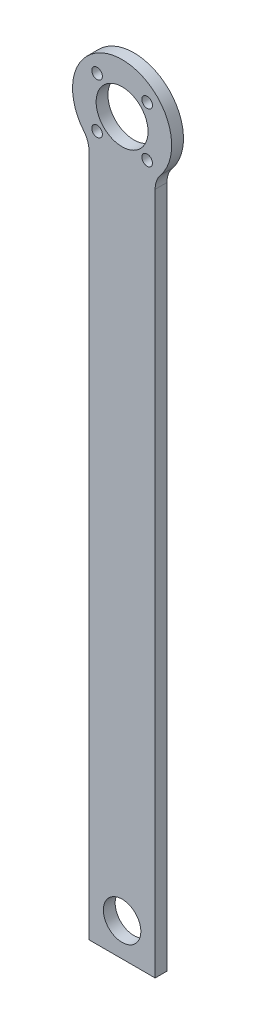
ISO-10303-21;
HEADER;
FILE_DESCRIPTION(('STEP AP214'),'2;1');
FILE_NAME('part.step','',(''),(''),'','','');
FILE_SCHEMA(('AUTOMOTIVE_DESIGN { 1 0 10303 214 1 1 1 1 }'));
ENDSEC;
DATA;
#1=APPLICATION_CONTEXT('core data for automotive mechanical design processes');
#2=APPLICATION_PROTOCOL_DEFINITION('international standard','automotive_design',2000,#1);
#3=PRODUCT_CONTEXT('',#1,'mechanical');
#4=PRODUCT('Part','Part','',(#3));
#5=PRODUCT_RELATED_PRODUCT_CATEGORY('part','',(#4));
#6=PRODUCT_DEFINITION_FORMATION('','',#4);
#7=PRODUCT_DEFINITION_CONTEXT('part definition',#1,'design');
#8=PRODUCT_DEFINITION('design','',#6,#7);
#9=PRODUCT_DEFINITION_SHAPE('','',#8);
#10=(LENGTH_UNIT() NAMED_UNIT(*) SI_UNIT(.MILLI.,.METRE.));
#11=(NAMED_UNIT(*) PLANE_ANGLE_UNIT() SI_UNIT($,.RADIAN.));
#12=(NAMED_UNIT(*) SI_UNIT($,.STERADIAN.) SOLID_ANGLE_UNIT());
#13=UNCERTAINTY_MEASURE_WITH_UNIT(LENGTH_MEASURE(1.E-05),#10,'distance_accuracy_value','');
#14=(GEOMETRIC_REPRESENTATION_CONTEXT(3) GLOBAL_UNCERTAINTY_ASSIGNED_CONTEXT((#13)) GLOBAL_UNIT_ASSIGNED_CONTEXT((#10,
#11,#12)) REPRESENTATION_CONTEXT('',''));
#15=CARTESIAN_POINT('',(0.,0.,0.));
#16=DIRECTION('',(0.,0.,1.));
#17=DIRECTION('',(1.,0.,0.));
#18=AXIS2_PLACEMENT_3D('',#15,#16,#17);
#19=CARTESIAN_POINT('',(42.,0.,4.99999999999998));
#20=DIRECTION('',(0.,0.,-1.));
#21=DIRECTION('',(-1.,0.,0.));
#22=AXIS2_PLACEMENT_3D('',#19,#20,#21);
#23=PLANE('',#22);
#24=CARTESIAN_POINT('',(21.,14.,4.99999999999999));
#25=DIRECTION('',(0.,0.,-1.));
#26=DIRECTION('',(-1.,0.,0.));
#27=AXIS2_PLACEMENT_3D('',#24,#25,#26);
#28=CIRCLE('',#27,7.9375);
#29=CARTESIAN_POINT('',(21.,21.9375,4.99999999999999));
#30=VERTEX_POINT('',#29);
#31=EDGE_CURVE('E309',#30,#30,#28,.F.);
#32=ORIENTED_EDGE('',*,*,#31,.F.);
#33=EDGE_LOOP('',(#32));
#34=FACE_BOUND('',#33,.T.);
#35=CARTESIAN_POINT('',(31.6066017177982,319.606601717798,4.99999999999998));
#36=DIRECTION('',(0.,0.,1.));
#37=DIRECTION('',(1.,0.,0.));
#38=AXIS2_PLACEMENT_3D('',#35,#36,#37);
#39=CIRCLE('',#38,2.25);
#40=CARTESIAN_POINT('',(33.8566017177982,319.606601717798,4.99999999999998));
#41=VERTEX_POINT('',#40);
#42=EDGE_CURVE('E324',#41,#41,#39,.T.);
#43=ORIENTED_EDGE('',*,*,#42,.F.);
#44=EDGE_LOOP('',(#43));
#45=FACE_BOUND('',#44,.T.);
#46=CARTESIAN_POINT('',(10.3933982822018,298.393398282202,4.99999999999998));
#47=DIRECTION('',(0.,0.,1.));
#48=DIRECTION('',(1.,0.,0.));
#49=AXIS2_PLACEMENT_3D('',#46,#47,#48);
#50=CIRCLE('',#49,2.25);
#51=CARTESIAN_POINT('',(12.6433982822018,298.393398282202,4.99999999999998));
#52=VERTEX_POINT('',#51);
#53=EDGE_CURVE('E186',#52,#52,#50,.T.);
#54=ORIENTED_EDGE('',*,*,#53,.F.);
#55=EDGE_LOOP('',(#54));
#56=FACE_BOUND('',#55,.T.);
#57=CARTESIAN_POINT('',(21.,309.,4.99999999999998));
#58=DIRECTION('',(0.,0.,1.));
#59=DIRECTION('',(1.,0.,0.));
#60=AXIS2_PLACEMENT_3D('',#57,#58,#59);
#61=CIRCLE('',#60,11.);
#62=CARTESIAN_POINT('',(32.,309.,4.99999999999998));
#63=VERTEX_POINT('',#62);
#64=EDGE_CURVE('E183',#63,#63,#61,.T.);
#65=ORIENTED_EDGE('',*,*,#64,.F.);
#66=EDGE_LOOP('',(#65));
#67=FACE_BOUND('',#66,.T.);
#68=DIRECTION('',(0.,-1.,0.));
#69=VECTOR('',#68,1.);
#70=CARTESIAN_POINT('',(35.,293.347524157502,5.00000000000006));
#71=LINE('',#70,#69);
#72=CARTESIAN_POINT('',(35.,289.378583129652,5.00000000000006));
#73=VERTEX_POINT('',#72);
#74=CARTESIAN_POINT('',(35.,0.,5.));
#75=VERTEX_POINT('',#74);
#76=EDGE_CURVE('E127',#73,#75,#71,.T.);
#77=ORIENTED_EDGE('',*,*,#76,.F.);
#78=CARTESIAN_POINT('',(45.,289.378583129652,4.99999999999998));
#79=DIRECTION('',(0.,0.,-1.));
#80=DIRECTION('',(-1.,0.,0.));
#81=AXIS2_PLACEMENT_3D('',#78,#79,#80);
#82=CIRCLE('',#81,10.);
#83=CARTESIAN_POINT('',(37.258064516129,295.708072442667,4.99999999999998));
#84=VERTEX_POINT('',#83);
#85=EDGE_CURVE('E14',#73,#84,#82,.T.);
#86=ORIENTED_EDGE('',*,*,#85,.T.);
#87=CARTESIAN_POINT('',(21.,309.,4.99999999999998));
#88=DIRECTION('',(0.,0.,1.));
#89=DIRECTION('',(1.,0.,0.));
#90=AXIS2_PLACEMENT_3D('',#87,#88,#89);
#91=CIRCLE('',#90,21.);
#92=CARTESIAN_POINT('',(4.74193548387091,295.708072442667,4.99999999999998));
#93=VERTEX_POINT('',#92);
#94=EDGE_CURVE('E167',#84,#93,#91,.T.);
#95=ORIENTED_EDGE('',*,*,#94,.T.);
#96=CARTESIAN_POINT('',(-3.00000000000007,289.378583129652,4.99999999999998));
#97=DIRECTION('',(0.,0.,-1.));
#98=DIRECTION('',(-1.,0.,0.));
#99=AXIS2_PLACEMENT_3D('',#96,#97,#98);
#100=CIRCLE('',#99,10.);
#101=CARTESIAN_POINT('',(6.99999999999993,289.378583129652,5.00000000000006));
#102=VERTEX_POINT('',#101);
#103=EDGE_CURVE('E159',#93,#102,#100,.T.);
#104=ORIENTED_EDGE('',*,*,#103,.T.);
#105=DIRECTION('',(0.,1.,0.));
#106=VECTOR('',#105,1.);
#107=CARTESIAN_POINT('',(6.99999999999997,0.,5.00000000000006));
#108=LINE('',#107,#106);
#109=CARTESIAN_POINT('',(6.99999999999997,0.,5.00000000000006));
#110=VERTEX_POINT('',#109);
#111=EDGE_CURVE('E137',#110,#102,#108,.T.);
#112=ORIENTED_EDGE('',*,*,#111,.F.);
#113=DIRECTION('',(-1.,0.,0.));
#114=VECTOR('',#113,1.);
#115=CARTESIAN_POINT('',(42.,0.,4.99999999999998));
#116=LINE('',#115,#114);
#117=EDGE_CURVE('E143',#75,#110,#116,.T.);
#118=ORIENTED_EDGE('',*,*,#117,.F.);
#119=EDGE_LOOP('',(#77,#86,#95,#104,#112,#118));
#120=FACE_BOUND('',#119,.T.);
#121=CARTESIAN_POINT('',(31.6066017177982,298.393398282202,4.99999999999998));
#122=DIRECTION('',(0.,0.,1.));
#123=DIRECTION('',(1.,0.,0.));
#124=AXIS2_PLACEMENT_3D('',#121,#122,#123);
#125=CIRCLE('',#124,2.25);
#126=CARTESIAN_POINT('',(33.8566017177982,298.393398282202,4.99999999999998));
#127=VERTEX_POINT('',#126);
#128=EDGE_CURVE('E330',#127,#127,#125,.T.);
#129=ORIENTED_EDGE('',*,*,#128,.F.);
#130=EDGE_LOOP('',(#129));
#131=FACE_BOUND('',#130,.T.);
#132=CARTESIAN_POINT('',(10.3933982822018,319.606601717798,4.99999999999998));
#133=DIRECTION('',(0.,0.,1.));
#134=DIRECTION('',(1.,0.,0.));
#135=AXIS2_PLACEMENT_3D('',#132,#133,#134);
#136=CIRCLE('',#135,2.25);
#137=CARTESIAN_POINT('',(12.6433982822018,319.606601717798,4.99999999999998));
#138=VERTEX_POINT('',#137);
#139=EDGE_CURVE('E315',#138,#138,#136,.T.);
#140=ORIENTED_EDGE('',*,*,#139,.F.);
#141=EDGE_LOOP('',(#140));
#142=FACE_BOUND('',#141,.T.);
#143=ADVANCED_FACE('F74',(#34,#45,#56,#67,#120,#131,#142),#23,.F.);
#144=CARTESIAN_POINT('',(42.,330.,0.));
#145=DIRECTION('',(0.,0.,1.));
#146=DIRECTION('',(0.,-1.,0.));
#147=AXIS2_PLACEMENT_3D('',#144,#145,#146);
#148=PLANE('',#147);
#149=CARTESIAN_POINT('',(21.,14.,0.));
#150=DIRECTION('',(0.,0.,-1.));
#151=DIRECTION('',(0.,1.,0.));
#152=AXIS2_PLACEMENT_3D('',#149,#150,#151);
#153=CIRCLE('',#152,7.9375);
#154=CARTESIAN_POINT('',(21.,21.9375,0.));
#155=VERTEX_POINT('',#154);
#156=EDGE_CURVE('E311',#155,#155,#153,.T.);
#157=ORIENTED_EDGE('',*,*,#156,.F.);
#158=EDGE_LOOP('',(#157));
#159=FACE_BOUND('',#158,.T.);
#160=CARTESIAN_POINT('',(10.3933982822018,319.606601717798,0.));
#161=DIRECTION('',(0.,0.,1.));
#162=DIRECTION('',(0.,-1.,0.));
#163=AXIS2_PLACEMENT_3D('',#160,#161,#162);
#164=CIRCLE('',#163,2.25);
#165=CARTESIAN_POINT('',(10.3933982822018,317.356601717798,0.));
#166=VERTEX_POINT('',#165);
#167=EDGE_CURVE('E321',#166,#166,#164,.T.);
#168=ORIENTED_EDGE('',*,*,#167,.T.);
#169=EDGE_LOOP('',(#168));
#170=FACE_BOUND('',#169,.T.);
#171=CARTESIAN_POINT('',(31.6066017177982,319.606601717798,0.));
#172=DIRECTION('',(0.,0.,1.));
#173=DIRECTION('',(0.,-1.,0.));
#174=AXIS2_PLACEMENT_3D('',#171,#172,#173);
#175=CIRCLE('',#174,2.25);
#176=CARTESIAN_POINT('',(31.6066017177982,317.356601717798,0.));
#177=VERTEX_POINT('',#176);
#178=EDGE_CURVE('E327',#177,#177,#175,.T.);
#179=ORIENTED_EDGE('',*,*,#178,.T.);
#180=EDGE_LOOP('',(#179));
#181=FACE_BOUND('',#180,.T.);
#182=CARTESIAN_POINT('',(31.6066017177982,298.393398282202,0.));
#183=DIRECTION('',(0.,0.,1.));
#184=DIRECTION('',(0.,-1.,0.));
#185=AXIS2_PLACEMENT_3D('',#182,#183,#184);
#186=CIRCLE('',#185,2.25);
#187=CARTESIAN_POINT('',(31.6066017177982,296.143398282202,0.));
#188=VERTEX_POINT('',#187);
#189=EDGE_CURVE('E333',#188,#188,#186,.T.);
#190=ORIENTED_EDGE('',*,*,#189,.T.);
#191=EDGE_LOOP('',(#190));
#192=FACE_BOUND('',#191,.T.);
#193=CARTESIAN_POINT('',(10.3933982822018,298.393398282202,0.));
#194=DIRECTION('',(0.,0.,1.));
#195=DIRECTION('',(0.,-1.,0.));
#196=AXIS2_PLACEMENT_3D('',#193,#194,#195);
#197=CIRCLE('',#196,2.25);
#198=CARTESIAN_POINT('',(10.3933982822018,296.143398282202,0.));
#199=VERTEX_POINT('',#198);
#200=EDGE_CURVE('E181',#199,#199,#197,.T.);
#201=ORIENTED_EDGE('',*,*,#200,.T.);
#202=EDGE_LOOP('',(#201));
#203=FACE_BOUND('',#202,.T.);
#204=CARTESIAN_POINT('',(21.,309.,0.));
#205=DIRECTION('',(0.,0.,1.));
#206=DIRECTION('',(0.,-1.,0.));
#207=AXIS2_PLACEMENT_3D('',#204,#205,#206);
#208=CIRCLE('',#207,11.);
#209=CARTESIAN_POINT('',(21.,298.,0.));
#210=VERTEX_POINT('',#209);
#211=EDGE_CURVE('E148',#210,#210,#208,.F.);
#212=ORIENTED_EDGE('',*,*,#211,.F.);
#213=EDGE_LOOP('',(#212));
#214=FACE_BOUND('',#213,.T.);
#215=DIRECTION('',(0.,-1.,0.));
#216=VECTOR('',#215,1.);
#217=CARTESIAN_POINT('',(6.99999999999997,0.,0.));
#218=LINE('',#217,#216);
#219=CARTESIAN_POINT('',(6.99999999999993,289.378583129652,0.));
#220=VERTEX_POINT('',#219);
#221=CARTESIAN_POINT('',(6.99999999999997,0.,0.));
#222=VERTEX_POINT('',#221);
#223=EDGE_CURVE('E177',#220,#222,#218,.T.);
#224=ORIENTED_EDGE('',*,*,#223,.F.);
#225=CARTESIAN_POINT('',(-3.00000000000007,289.378583129652,0.));
#226=DIRECTION('',(0.,0.,1.));
#227=DIRECTION('',(0.,-1.,0.));
#228=AXIS2_PLACEMENT_3D('',#225,#226,#227);
#229=CIRCLE('',#228,10.);
#230=CARTESIAN_POINT('',(4.74193548387091,295.708072442667,0.));
#231=VERTEX_POINT('',#230);
#232=EDGE_CURVE('E157',#220,#231,#229,.T.);
#233=ORIENTED_EDGE('',*,*,#232,.T.);
#234=CARTESIAN_POINT('',(21.,309.,0.));
#235=DIRECTION('',(0.,0.,1.));
#236=DIRECTION('',(0.,-1.,0.));
#237=AXIS2_PLACEMENT_3D('',#234,#235,#236);
#238=CIRCLE('',#237,21.);
#239=CARTESIAN_POINT('',(37.258064516129,295.708072442667,0.));
#240=VERTEX_POINT('',#239);
#241=EDGE_CURVE('E176',#231,#240,#238,.F.);
#242=ORIENTED_EDGE('',*,*,#241,.T.);
#243=CARTESIAN_POINT('',(45.,289.378583129652,0.));
#244=DIRECTION('',(0.,0.,1.));
#245=DIRECTION('',(0.,-1.,0.));
#246=AXIS2_PLACEMENT_3D('',#243,#244,#245);
#247=CIRCLE('',#246,10.);
#248=CARTESIAN_POINT('',(35.,289.378583129652,0.));
#249=VERTEX_POINT('',#248);
#250=EDGE_CURVE('E82',#240,#249,#247,.T.);
#251=ORIENTED_EDGE('',*,*,#250,.T.);
#252=DIRECTION('',(0.,1.,0.));
#253=VECTOR('',#252,1.);
#254=CARTESIAN_POINT('',(35.,293.347524157502,0.));
#255=LINE('',#254,#253);
#256=CARTESIAN_POINT('',(35.,0.,0.));
#257=VERTEX_POINT('',#256);
#258=EDGE_CURVE('E126',#257,#249,#255,.T.);
#259=ORIENTED_EDGE('',*,*,#258,.F.);
#260=DIRECTION('',(-1.,0.,0.));
#261=VECTOR('',#260,1.);
#262=CARTESIAN_POINT('',(42.,0.,0.));
#263=LINE('',#262,#261);
#264=EDGE_CURVE('E136',#257,#222,#263,.T.);
#265=ORIENTED_EDGE('',*,*,#264,.T.);
#266=EDGE_LOOP('',(#224,#233,#242,#251,#259,#265));
#267=FACE_BOUND('',#266,.T.);
#268=ADVANCED_FACE('F135',(#159,#170,#181,#192,#203,#214,#267),#148,.F.);
#269=CARTESIAN_POINT('',(42.,0.,0.));
#270=DIRECTION('',(0.,1.,0.));
#271=DIRECTION('',(0.,0.,1.));
#272=AXIS2_PLACEMENT_3D('',#269,#270,#271);
#273=PLANE('',#272);
#274=ORIENTED_EDGE('',*,*,#264,.F.);
#275=DIRECTION('',(0.,0.,-1.));
#276=VECTOR('',#275,1.);
#277=CARTESIAN_POINT('',(35.,0.,314.079277856022));
#278=LINE('',#277,#276);
#279=EDGE_CURVE('E124',#75,#257,#278,.T.);
#280=ORIENTED_EDGE('',*,*,#279,.F.);
#281=ORIENTED_EDGE('',*,*,#117,.T.);
#282=DIRECTION('',(0.,0.,-1.));
#283=VECTOR('',#282,1.);
#284=CARTESIAN_POINT('',(6.99999999999997,0.,314.079277856022));
#285=LINE('',#284,#283);
#286=EDGE_CURVE('E141',#110,#222,#285,.T.);
#287=ORIENTED_EDGE('',*,*,#286,.T.);
#288=EDGE_LOOP('',(#274,#280,#281,#287));
#289=FACE_BOUND('',#288,.T.);
#290=ADVANCED_FACE('F140',(#289),#273,.F.);
#291=CARTESIAN_POINT('',(21.,309.,-31.1126983722081));
#292=DIRECTION('',(0.,0.,1.));
#293=DIRECTION('',(1.,0.,0.));
#294=AXIS2_PLACEMENT_3D('',#291,#292,#293);
#295=CYLINDRICAL_SURFACE('',#294,21.);
#296=ORIENTED_EDGE('',*,*,#241,.F.);
#297=DIRECTION('',(0.,0.,1.));
#298=VECTOR('',#297,1.);
#299=CARTESIAN_POINT('',(4.74193548387091,295.708072442667,-31.1126983722081));
#300=LINE('',#299,#298);
#301=EDGE_CURVE('E154',#231,#93,#300,.T.);
#302=ORIENTED_EDGE('',*,*,#301,.T.);
#303=ORIENTED_EDGE('',*,*,#94,.F.);
#304=DIRECTION('',(0.,0.,1.));
#305=VECTOR('',#304,1.);
#306=CARTESIAN_POINT('',(37.258064516129,295.708072442667,-31.1126983722081));
#307=LINE('',#306,#305);
#308=EDGE_CURVE('E146',#84,#240,#307,.F.);
#309=ORIENTED_EDGE('',*,*,#308,.T.);
#310=EDGE_LOOP('',(#296,#302,#303,#309));
#311=FACE_BOUND('',#310,.T.);
#312=ADVANCED_FACE('F179',(#311),#295,.T.);
#313=CARTESIAN_POINT('',(21.,309.,-31.1126983722081));
#314=DIRECTION('',(0.,0.,1.));
#315=DIRECTION('',(1.,0.,0.));
#316=AXIS2_PLACEMENT_3D('',#313,#314,#315);
#317=CYLINDRICAL_SURFACE('',#316,11.);
#318=ORIENTED_EDGE('',*,*,#211,.T.);
#319=EDGE_LOOP('',(#318));
#320=FACE_BOUND('',#319,.T.);
#321=ORIENTED_EDGE('',*,*,#64,.T.);
#322=EDGE_LOOP('',(#321));
#323=FACE_BOUND('',#322,.T.);
#324=ADVANCED_FACE('F193',(#320,#323),#317,.F.);
#325=CARTESIAN_POINT('',(10.3933982822018,298.393398282202,4.99999999999998));
#326=DIRECTION('',(0.,0.,1.));
#327=DIRECTION('',(1.,0.,0.));
#328=AXIS2_PLACEMENT_3D('',#325,#326,#327);
#329=CYLINDRICAL_SURFACE('',#328,2.25);
#330=ORIENTED_EDGE('',*,*,#200,.F.);
#331=EDGE_LOOP('',(#330));
#332=FACE_BOUND('',#331,.T.);
#333=ORIENTED_EDGE('',*,*,#53,.T.);
#334=EDGE_LOOP('',(#333));
#335=FACE_BOUND('',#334,.T.);
#336=ADVANCED_FACE('F234',(#332,#335),#329,.F.);
#337=CARTESIAN_POINT('',(31.6066017177982,298.393398282202,4.99999999999998));
#338=DIRECTION('',(0.,0.,1.));
#339=DIRECTION('',(1.,0.,0.));
#340=AXIS2_PLACEMENT_3D('',#337,#338,#339);
#341=CYLINDRICAL_SURFACE('',#340,2.25);
#342=ORIENTED_EDGE('',*,*,#189,.F.);
#343=EDGE_LOOP('',(#342));
#344=FACE_BOUND('',#343,.T.);
#345=ORIENTED_EDGE('',*,*,#128,.T.);
#346=EDGE_LOOP('',(#345));
#347=FACE_BOUND('',#346,.T.);
#348=ADVANCED_FACE('F230',(#344,#347),#341,.F.);
#349=CARTESIAN_POINT('',(31.6066017177982,319.606601717798,4.99999999999998));
#350=DIRECTION('',(0.,0.,1.));
#351=DIRECTION('',(1.,0.,0.));
#352=AXIS2_PLACEMENT_3D('',#349,#350,#351);
#353=CYLINDRICAL_SURFACE('',#352,2.25);
#354=ORIENTED_EDGE('',*,*,#178,.F.);
#355=EDGE_LOOP('',(#354));
#356=FACE_BOUND('',#355,.T.);
#357=ORIENTED_EDGE('',*,*,#42,.T.);
#358=EDGE_LOOP('',(#357));
#359=FACE_BOUND('',#358,.T.);
#360=ADVANCED_FACE('F226',(#356,#359),#353,.F.);
#361=CARTESIAN_POINT('',(10.3933982822018,319.606601717798,4.99999999999998));
#362=DIRECTION('',(0.,0.,1.));
#363=DIRECTION('',(1.,0.,0.));
#364=AXIS2_PLACEMENT_3D('',#361,#362,#363);
#365=CYLINDRICAL_SURFACE('',#364,2.25);
#366=ORIENTED_EDGE('',*,*,#167,.F.);
#367=EDGE_LOOP('',(#366));
#368=FACE_BOUND('',#367,.T.);
#369=ORIENTED_EDGE('',*,*,#139,.T.);
#370=EDGE_LOOP('',(#369));
#371=FACE_BOUND('',#370,.T.);
#372=ADVANCED_FACE('F220',(#368,#371),#365,.F.);
#373=CARTESIAN_POINT('',(6.99999999999997,0.,314.079277856022));
#374=DIRECTION('',(1.,0.,0.));
#375=DIRECTION('',(0.,1.,0.));
#376=AXIS2_PLACEMENT_3D('',#373,#374,#375);
#377=PLANE('',#376);
#378=ORIENTED_EDGE('',*,*,#111,.T.);
#379=DIRECTION('',(0.,0.,1.));
#380=VECTOR('',#379,1.);
#381=CARTESIAN_POINT('',(6.99999999999993,289.378583129652,314.079277856022));
#382=LINE('',#381,#380);
#383=EDGE_CURVE('E142',#102,#220,#382,.F.);
#384=ORIENTED_EDGE('',*,*,#383,.T.);
#385=ORIENTED_EDGE('',*,*,#223,.T.);
#386=ORIENTED_EDGE('',*,*,#286,.F.);
#387=EDGE_LOOP('',(#378,#384,#385,#386));
#388=FACE_BOUND('',#387,.T.);
#389=ADVANCED_FACE('F172',(#388),#377,.F.);
#390=CARTESIAN_POINT('',(35.,293.347524157502,314.079277856022));
#391=DIRECTION('',(-1.,0.,0.));
#392=DIRECTION('',(0.,-1.,0.));
#393=AXIS2_PLACEMENT_3D('',#390,#391,#392);
#394=PLANE('',#393);
#395=ORIENTED_EDGE('',*,*,#258,.T.);
#396=DIRECTION('',(0.,0.,1.));
#397=VECTOR('',#396,1.);
#398=CARTESIAN_POINT('',(35.,289.378583129652,314.079277856022));
#399=LINE('',#398,#397);
#400=EDGE_CURVE('E95',#249,#73,#399,.T.);
#401=ORIENTED_EDGE('',*,*,#400,.T.);
#402=ORIENTED_EDGE('',*,*,#76,.T.);
#403=ORIENTED_EDGE('',*,*,#279,.T.);
#404=EDGE_LOOP('',(#395,#401,#402,#403));
#405=FACE_BOUND('',#404,.T.);
#406=ADVANCED_FACE('F125',(#405),#394,.F.);
#407=CARTESIAN_POINT('',(-3.00000000000007,289.378583129652,-31.1126983722081));
#408=DIRECTION('',(0.,0.,1.));
#409=DIRECTION('',(1.,0.,0.));
#410=AXIS2_PLACEMENT_3D('',#407,#408,#409);
#411=CYLINDRICAL_SURFACE('',#410,10.);
#412=ORIENTED_EDGE('',*,*,#103,.F.);
#413=ORIENTED_EDGE('',*,*,#301,.F.);
#414=ORIENTED_EDGE('',*,*,#232,.F.);
#415=ORIENTED_EDGE('',*,*,#383,.F.);
#416=EDGE_LOOP('',(#412,#413,#414,#415));
#417=FACE_BOUND('',#416,.T.);
#418=ADVANCED_FACE('F174',(#417),#411,.F.);
#419=CARTESIAN_POINT('',(45.,289.378583129652,-31.1126983722081));
#420=DIRECTION('',(0.,0.,1.));
#421=DIRECTION('',(1.,0.,0.));
#422=AXIS2_PLACEMENT_3D('',#419,#420,#421);
#423=CYLINDRICAL_SURFACE('',#422,10.);
#424=ORIENTED_EDGE('',*,*,#85,.F.);
#425=ORIENTED_EDGE('',*,*,#400,.F.);
#426=ORIENTED_EDGE('',*,*,#250,.F.);
#427=ORIENTED_EDGE('',*,*,#308,.F.);
#428=EDGE_LOOP('',(#424,#425,#426,#427));
#429=FACE_BOUND('',#428,.T.);
#430=ADVANCED_FACE('F76',(#429),#423,.F.);
#431=CARTESIAN_POINT('',(21.,14.,27.4506403026729));
#432=DIRECTION('',(0.,0.,-1.));
#433=DIRECTION('',(0.,1.,0.));
#434=AXIS2_PLACEMENT_3D('',#431,#432,#433);
#435=CYLINDRICAL_SURFACE('',#434,7.9375);
#436=CARTESIAN_POINT('',(21.,21.9375,4.99999999999999));
#437=CARTESIAN_POINT('',(21.,21.9375,4.94791666666665));
#438=CARTESIAN_POINT('',(21.,21.9375,4.89583333333332));
#439=CARTESIAN_POINT('',(21.,21.9375,4.79166666666665));
#440=CARTESIAN_POINT('',(21.,21.9375,4.73958333333332));
#441=CARTESIAN_POINT('',(21.,21.9375,4.63541666666665));
#442=CARTESIAN_POINT('',(21.,21.9375,4.58333333333332));
#443=CARTESIAN_POINT('',(21.,21.9375,4.47916666666666));
#444=CARTESIAN_POINT('',(21.,21.9375,4.42708333333332));
#445=CARTESIAN_POINT('',(21.,21.9375,4.32291666666666));
#446=CARTESIAN_POINT('',(21.,21.9375,4.27083333333332));
#447=CARTESIAN_POINT('',(21.,21.9375,4.16666666666666));
#448=CARTESIAN_POINT('',(21.,21.9375,4.11458333333332));
#449=CARTESIAN_POINT('',(21.,21.9375,4.01041666666666));
#450=CARTESIAN_POINT('',(21.,21.9375,3.95833333333332));
#451=CARTESIAN_POINT('',(21.,21.9375,3.85416666666666));
#452=CARTESIAN_POINT('',(21.,21.9375,3.80208333333333));
#453=CARTESIAN_POINT('',(21.,21.9375,3.69791666666666));
#454=CARTESIAN_POINT('',(21.,21.9375,3.64583333333333));
#455=CARTESIAN_POINT('',(21.,21.9375,3.54166666666666));
#456=CARTESIAN_POINT('',(21.,21.9375,3.48958333333333));
#457=CARTESIAN_POINT('',(21.,21.9375,3.38541666666666));
#458=CARTESIAN_POINT('',(21.,21.9375,3.33333333333333));
#459=CARTESIAN_POINT('',(21.,21.9375,3.22916666666666));
#460=CARTESIAN_POINT('',(21.,21.9375,3.17708333333333));
#461=CARTESIAN_POINT('',(21.,21.9375,3.07291666666666));
#462=CARTESIAN_POINT('',(21.,21.9375,3.02083333333333));
#463=CARTESIAN_POINT('',(21.,21.9375,2.91666666666666));
#464=CARTESIAN_POINT('',(21.,21.9375,2.86458333333333));
#465=CARTESIAN_POINT('',(21.,21.9375,2.76041666666666));
#466=CARTESIAN_POINT('',(21.,21.9375,2.70833333333333));
#467=CARTESIAN_POINT('',(21.,21.9375,2.60416666666666));
#468=CARTESIAN_POINT('',(21.,21.9375,2.55208333333333));
#469=CARTESIAN_POINT('',(21.,21.9375,2.44791666666666));
#470=CARTESIAN_POINT('',(21.,21.9375,2.39583333333333));
#471=CARTESIAN_POINT('',(21.,21.9375,2.29166666666666));
#472=CARTESIAN_POINT('',(21.,21.9375,2.23958333333333));
#473=CARTESIAN_POINT('',(21.,21.9375,2.13541666666666));
#474=CARTESIAN_POINT('',(21.,21.9375,2.08333333333333));
#475=CARTESIAN_POINT('',(21.,21.9375,1.97916666666666));
#476=CARTESIAN_POINT('',(21.,21.9375,1.92708333333333));
#477=CARTESIAN_POINT('',(21.,21.9375,1.82291666666666));
#478=CARTESIAN_POINT('',(21.,21.9375,1.77083333333333));
#479=CARTESIAN_POINT('',(21.,21.9375,1.66666666666666));
#480=CARTESIAN_POINT('',(21.,21.9375,1.61458333333333));
#481=CARTESIAN_POINT('',(21.,21.9375,1.51041666666666));
#482=CARTESIAN_POINT('',(21.,21.9375,1.45833333333333));
#483=CARTESIAN_POINT('',(21.,21.9375,1.35416666666666));
#484=CARTESIAN_POINT('',(21.,21.9375,1.30208333333333));
#485=CARTESIAN_POINT('',(21.,21.9375,1.19791666666667));
#486=CARTESIAN_POINT('',(21.,21.9375,1.14583333333333));
#487=CARTESIAN_POINT('',(21.,21.9375,1.04166666666667));
#488=CARTESIAN_POINT('',(21.,21.9375,0.989583333333334));
#489=CARTESIAN_POINT('',(21.,21.9375,0.885416666666668));
#490=CARTESIAN_POINT('',(21.,21.9375,0.833333333333334));
#491=CARTESIAN_POINT('',(21.,21.9375,0.729166666666667));
#492=CARTESIAN_POINT('',(21.,21.9375,0.677083333333334));
#493=CARTESIAN_POINT('',(21.,21.9375,0.572916666666667));
#494=CARTESIAN_POINT('',(21.,21.9375,0.520833333333334));
#495=CARTESIAN_POINT('',(21.,21.9375,0.416666666666668));
#496=CARTESIAN_POINT('',(21.,21.9375,0.364583333333336));
#497=CARTESIAN_POINT('',(21.,21.9375,0.26041666666667));
#498=CARTESIAN_POINT('',(21.,21.9375,0.208333333333337));
#499=CARTESIAN_POINT('',(21.,21.9375,0.10416666666667));
#500=CARTESIAN_POINT('',(21.,21.9375,0.0520833333333369));
#501=CARTESIAN_POINT('',(21.,21.9375,0.));
#502=B_SPLINE_CURVE_WITH_KNOTS('',3,(#436,#437,#438,#439,#440,#441,#442,#443,#444,#445,#446,
#447,#448,#449,#450,#451,#452,#453,#454,#455,#456,#457,#458,#459,#460,#461,#462,#463,#464,#465,
#466,#467,#468,#469,#470,#471,#472,#473,#474,#475,#476,#477,#478,#479,#480,#481,#482,#483,#484,
#485,#486,#487,#488,#489,#490,#491,#492,#493,#494,#495,#496,#497,#498,#499,#500,#501),
.UNSPECIFIED.,.F.,.F.,(4,2,2,2,2,2,2,2,2,2,2,2,2,2,2,2,2,2,2,2,2,2,2,2,2,2,2,2,2,2,2,2,4),(0.,
0.15625,0.3125,0.468749999999997,0.624999999999997,0.781249999999997,0.937499999999997,1.09375,
1.24999999999999,1.40624999999999,1.56249999999999,1.71874999999999,1.87499999999999,
2.03124999999999,2.18749999999999,2.34374999999999,2.49999999999999,2.65624999999999,
2.81249999999999,2.96874999999999,3.12499999999999,3.28124999999999,3.43749999999999,
3.59374999999999,3.74999999999999,3.90624999999999,4.06249999999999,4.21874999999999,
4.37499999999999,4.53124999999999,4.68749999999998,4.84374999999998,4.99999999999998),.UNSPECIFIED.);
#503=EDGE_CURVE('BSEAM214',#30,#155,#502,.T.);
#504=ORIENTED_EDGE('',*,*,#31,.T.);
#505=ORIENTED_EDGE('',*,*,#156,.T.);
#506=ORIENTED_EDGE('',*,*,#503,.T.);
#507=ORIENTED_EDGE('',*,*,#503,.F.);
#508=EDGE_LOOP('',(#504,#506,#505,#507));
#509=FACE_BOUND('',#508,.T.);
#510=ADVANCED_FACE('F214',(#509),#435,.F.);
#511=CLOSED_SHELL('',(#143,#268,#290,#312,#324,#336,#348,#360,#372,#389,#406,#418,#430,#510));
#512=MANIFOLD_SOLID_BREP('B2',#511);
#513=ADVANCED_BREP_SHAPE_REPRESENTATION('',(#18,#512),#14);
#514=SHAPE_DEFINITION_REPRESENTATION(#9,#513);
ENDSEC;
END-ISO-10303-21;
